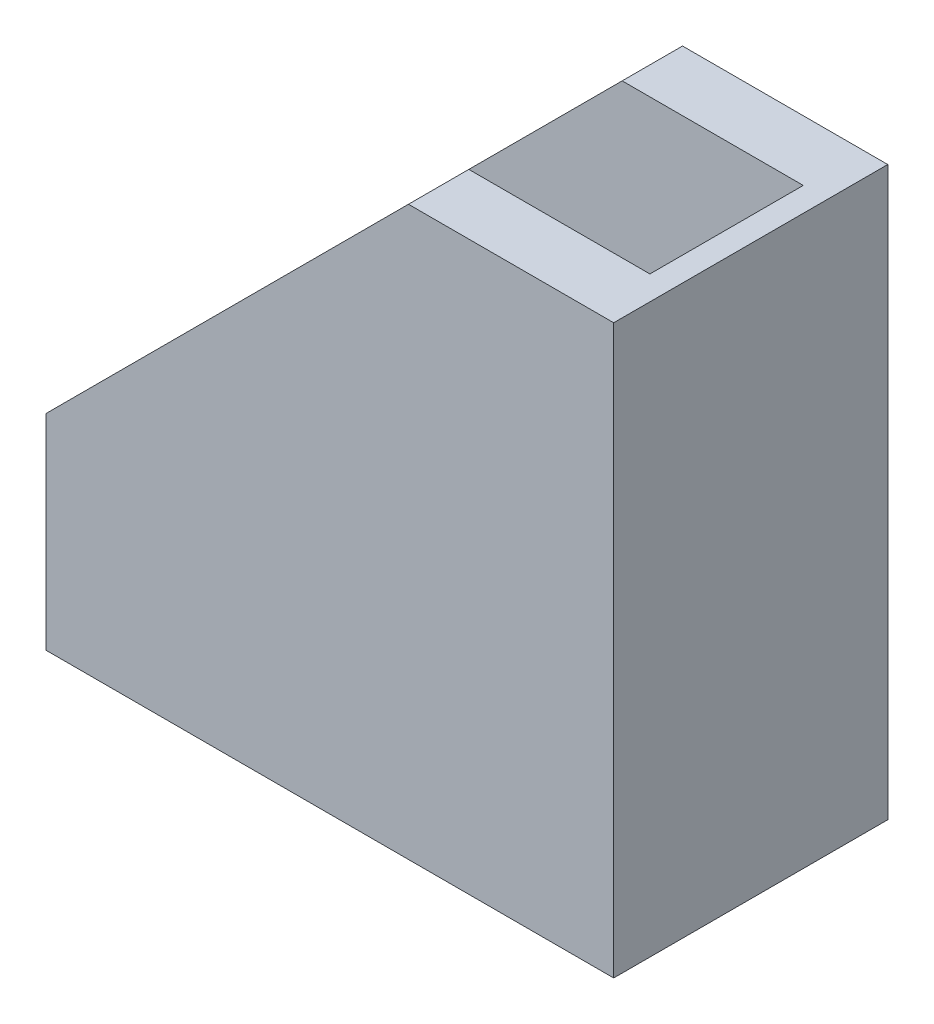
ISO-10303-21;
HEADER;
FILE_DESCRIPTION(('STEP AP214'),'2;1');
FILE_NAME('part.step','',(''),(''),'','','');
FILE_SCHEMA(('AUTOMOTIVE_DESIGN { 1 0 10303 214 1 1 1 1 }'));
ENDSEC;
DATA;
#1=APPLICATION_CONTEXT('core data for automotive mechanical design processes');
#2=APPLICATION_PROTOCOL_DEFINITION('international standard','automotive_design',2000,#1);
#3=PRODUCT_CONTEXT('',#1,'mechanical');
#4=PRODUCT('Part','Part','',(#3));
#5=PRODUCT_RELATED_PRODUCT_CATEGORY('part','',(#4));
#6=PRODUCT_DEFINITION_FORMATION('','',#4);
#7=PRODUCT_DEFINITION_CONTEXT('part definition',#1,'design');
#8=PRODUCT_DEFINITION('design','',#6,#7);
#9=PRODUCT_DEFINITION_SHAPE('','',#8);
#10=(LENGTH_UNIT() NAMED_UNIT(*) SI_UNIT(.MILLI.,.METRE.));
#11=(NAMED_UNIT(*) PLANE_ANGLE_UNIT() SI_UNIT($,.RADIAN.));
#12=(NAMED_UNIT(*) SI_UNIT($,.STERADIAN.) SOLID_ANGLE_UNIT());
#13=UNCERTAINTY_MEASURE_WITH_UNIT(LENGTH_MEASURE(1.E-05),#10,'distance_accuracy_value','');
#14=(GEOMETRIC_REPRESENTATION_CONTEXT(3) GLOBAL_UNCERTAINTY_ASSIGNED_CONTEXT((#13)) GLOBAL_UNIT_ASSIGNED_CONTEXT((#10,
#11,#12)) REPRESENTATION_CONTEXT('',''));
#15=CARTESIAN_POINT('',(0.,0.,0.));
#16=DIRECTION('',(0.,0.,1.));
#17=DIRECTION('',(1.,0.,0.));
#18=AXIS2_PLACEMENT_3D('',#15,#16,#17);
#19=CARTESIAN_POINT('',(-17.,47.,11.35));
#20=DIRECTION('',(0.707106781186548,-0.707106781186548,0.));
#21=DIRECTION('',(0.707106781186548,0.707106781186548,0.));
#22=AXIS2_PLACEMENT_3D('',#19,#20,#21);
#23=PLANE('',#22);
#24=DIRECTION('',(-0.707106781186547,-0.707106781186547,0.));
#25=VECTOR('',#24,1.);
#26=CARTESIAN_POINT('',(-47.,17.,6.35));
#27=LINE('',#26,#25);
#28=CARTESIAN_POINT('',(-17.,47.,6.35));
#29=VERTEX_POINT('',#28);
#30=CARTESIAN_POINT('',(-47.,17.,6.35));
#31=VERTEX_POINT('',#30);
#32=EDGE_CURVE('E172',#29,#31,#27,.T.);
#33=ORIENTED_EDGE('',*,*,#32,.T.);
#34=DIRECTION('',(0.,0.,-1.));
#35=VECTOR('',#34,1.);
#36=CARTESIAN_POINT('',(-47.,17.,11.35));
#37=LINE('',#36,#35);
#38=CARTESIAN_POINT('',(-47.,17.,11.35));
#39=VERTEX_POINT('',#38);
#40=EDGE_CURVE('E117',#39,#31,#37,.T.);
#41=ORIENTED_EDGE('',*,*,#40,.F.);
#42=DIRECTION('',(-0.707106781186547,-0.707106781186547,0.));
#43=VECTOR('',#42,1.);
#44=CARTESIAN_POINT('',(-17.,47.,11.35));
#45=LINE('',#44,#43);
#46=CARTESIAN_POINT('',(-17.,47.,11.35));
#47=VERTEX_POINT('',#46);
#48=EDGE_CURVE('E99',#47,#39,#45,.T.);
#49=ORIENTED_EDGE('',*,*,#48,.F.);
#50=DIRECTION('',(0.,0.,-1.));
#51=VECTOR('',#50,1.);
#52=CARTESIAN_POINT('',(-17.,47.,11.35));
#53=LINE('',#52,#51);
#54=EDGE_CURVE('E106',#47,#29,#53,.T.);
#55=ORIENTED_EDGE('',*,*,#54,.T.);
#56=EDGE_LOOP('',(#33,#41,#49,#55));
#57=FACE_BOUND('',#56,.T.);
#58=ADVANCED_FACE('F33',(#57),#23,.F.);
#59=CARTESIAN_POINT('',(0.,0.,11.35));
#60=DIRECTION('',(0.,1.,0.));
#61=DIRECTION('',(-1.,0.,0.));
#62=AXIS2_PLACEMENT_3D('',#59,#60,#61);
#63=PLANE('',#62);
#64=DIRECTION('',(1.,0.,0.));
#65=VECTOR('',#64,1.);
#66=CARTESIAN_POINT('',(0.,0.,-11.35));
#67=LINE('',#66,#65);
#68=CARTESIAN_POINT('',(-47.,0.,-11.35));
#69=VERTEX_POINT('',#68);
#70=CARTESIAN_POINT('',(0.,0.,-11.35));
#71=VERTEX_POINT('',#70);
#72=EDGE_CURVE('E123',#69,#71,#67,.T.);
#73=ORIENTED_EDGE('',*,*,#72,.T.);
#74=DIRECTION('',(0.,0.,-1.));
#75=VECTOR('',#74,1.);
#76=CARTESIAN_POINT('',(0.,0.,11.35));
#77=LINE('',#76,#75);
#78=CARTESIAN_POINT('',(0.,0.,11.35));
#79=VERTEX_POINT('',#78);
#80=EDGE_CURVE('E11',#79,#71,#77,.T.);
#81=ORIENTED_EDGE('',*,*,#80,.F.);
#82=DIRECTION('',(1.,0.,0.));
#83=VECTOR('',#82,1.);
#84=CARTESIAN_POINT('',(0.,0.,11.35));
#85=LINE('',#84,#83);
#86=CARTESIAN_POINT('',(-47.,0.,11.35));
#87=VERTEX_POINT('',#86);
#88=EDGE_CURVE('E136',#87,#79,#85,.T.);
#89=ORIENTED_EDGE('',*,*,#88,.F.);
#90=DIRECTION('',(0.,0.,-1.));
#91=VECTOR('',#90,1.);
#92=CARTESIAN_POINT('',(-47.,0.,11.35));
#93=LINE('',#92,#91);
#94=EDGE_CURVE('E119',#87,#69,#93,.T.);
#95=ORIENTED_EDGE('',*,*,#94,.T.);
#96=EDGE_LOOP('',(#73,#81,#89,#95));
#97=FACE_BOUND('',#96,.T.);
#98=ADVANCED_FACE('F35',(#97),#63,.F.);
#99=CARTESIAN_POINT('',(0.,0.,11.35));
#100=DIRECTION('',(-1.,0.,0.));
#101=DIRECTION('',(0.,0.,1.));
#102=AXIS2_PLACEMENT_3D('',#99,#100,#101);
#103=PLANE('',#102);
#104=DIRECTION('',(0.,1.,0.));
#105=VECTOR('',#104,1.);
#106=CARTESIAN_POINT('',(0.,0.,-11.35));
#107=LINE('',#106,#105);
#108=CARTESIAN_POINT('',(0.,47.,-11.35));
#109=VERTEX_POINT('',#108);
#110=EDGE_CURVE('E126',#71,#109,#107,.T.);
#111=ORIENTED_EDGE('',*,*,#110,.T.);
#112=DIRECTION('',(0.,0.,-1.));
#113=VECTOR('',#112,1.);
#114=CARTESIAN_POINT('',(0.,47.,11.35));
#115=LINE('',#114,#113);
#116=CARTESIAN_POINT('',(0.,47.,11.35));
#117=VERTEX_POINT('',#116);
#118=EDGE_CURVE('E41',#117,#109,#115,.T.);
#119=ORIENTED_EDGE('',*,*,#118,.F.);
#120=DIRECTION('',(0.,1.,0.));
#121=VECTOR('',#120,1.);
#122=CARTESIAN_POINT('',(0.,0.,11.35));
#123=LINE('',#122,#121);
#124=EDGE_CURVE('E88',#79,#117,#123,.T.);
#125=ORIENTED_EDGE('',*,*,#124,.F.);
#126=ORIENTED_EDGE('',*,*,#80,.T.);
#127=EDGE_LOOP('',(#111,#119,#125,#126));
#128=FACE_BOUND('',#127,.T.);
#129=ADVANCED_FACE('F211',(#128),#103,.F.);
#130=CARTESIAN_POINT('',(0.,47.,11.35));
#131=DIRECTION('',(0.,-1.,0.));
#132=DIRECTION('',(0.,0.,-1.));
#133=AXIS2_PLACEMENT_3D('',#130,#131,#132);
#134=PLANE('',#133);
#135=CARTESIAN_POINT('',(-17.,47.,-6.35));
#136=VERTEX_POINT('',#135);
#137=CARTESIAN_POINT('',(-17.,47.,-11.35));
#138=VERTEX_POINT('',#137);
#139=EDGE_CURVE('E114',#136,#138,#53,.T.);
#140=ORIENTED_EDGE('',*,*,#139,.F.);
#141=DIRECTION('',(-1.,0.,0.));
#142=VECTOR('',#141,1.);
#143=CARTESIAN_POINT('',(-17.,47.,-6.35));
#144=LINE('',#143,#142);
#145=CARTESIAN_POINT('',(-2.,47.,-6.35));
#146=VERTEX_POINT('',#145);
#147=EDGE_CURVE('E154',#146,#136,#144,.T.);
#148=ORIENTED_EDGE('',*,*,#147,.F.);
#149=DIRECTION('',(0.,0.,1.));
#150=VECTOR('',#149,1.);
#151=CARTESIAN_POINT('',(-2.,47.,-6.35));
#152=LINE('',#151,#150);
#153=CARTESIAN_POINT('',(-2.,47.,6.35));
#154=VERTEX_POINT('',#153);
#155=EDGE_CURVE('E127',#146,#154,#152,.T.);
#156=ORIENTED_EDGE('',*,*,#155,.T.);
#157=DIRECTION('',(-1.,0.,0.));
#158=VECTOR('',#157,1.);
#159=CARTESIAN_POINT('',(-17.,47.,6.35));
#160=LINE('',#159,#158);
#161=EDGE_CURVE('E111',#154,#29,#160,.T.);
#162=ORIENTED_EDGE('',*,*,#161,.T.);
#163=ORIENTED_EDGE('',*,*,#54,.F.);
#164=DIRECTION('',(-1.,0.,0.));
#165=VECTOR('',#164,1.);
#166=CARTESIAN_POINT('',(0.,47.,11.35));
#167=LINE('',#166,#165);
#168=EDGE_CURVE('E95',#117,#47,#167,.T.);
#169=ORIENTED_EDGE('',*,*,#168,.F.);
#170=ORIENTED_EDGE('',*,*,#118,.T.);
#171=DIRECTION('',(-1.,0.,0.));
#172=VECTOR('',#171,1.);
#173=CARTESIAN_POINT('',(0.,47.,-11.35));
#174=LINE('',#173,#172);
#175=EDGE_CURVE('E129',#109,#138,#174,.T.);
#176=ORIENTED_EDGE('',*,*,#175,.T.);
#177=EDGE_LOOP('',(#140,#148,#156,#162,#163,#169,#170,#176));
#178=FACE_BOUND('',#177,.T.);
#179=ADVANCED_FACE('F108',(#178),#134,.F.);
#180=CARTESIAN_POINT('',(-47.,17.,-6.35));
#181=VERTEX_POINT('',#180);
#182=CARTESIAN_POINT('',(-47.,17.,-11.35));
#183=VERTEX_POINT('',#182);
#184=EDGE_CURVE('E138',#181,#183,#37,.T.);
#185=ORIENTED_EDGE('',*,*,#184,.F.);
#186=DIRECTION('',(-0.707106781186547,-0.707106781186547,0.));
#187=VECTOR('',#186,1.);
#188=CARTESIAN_POINT('',(-47.,17.,-6.35));
#189=LINE('',#188,#187);
#190=EDGE_CURVE('E150',#136,#181,#189,.T.);
#191=ORIENTED_EDGE('',*,*,#190,.F.);
#192=ORIENTED_EDGE('',*,*,#139,.T.);
#193=DIRECTION('',(-0.707106781186547,-0.707106781186547,0.));
#194=VECTOR('',#193,1.);
#195=CARTESIAN_POINT('',(-17.,47.,-11.35));
#196=LINE('',#195,#194);
#197=EDGE_CURVE('E132',#138,#183,#196,.T.);
#198=ORIENTED_EDGE('',*,*,#197,.T.);
#199=EDGE_LOOP('',(#185,#191,#192,#198));
#200=FACE_BOUND('',#199,.T.);
#201=ADVANCED_FACE('F146',(#200),#23,.F.);
#202=CARTESIAN_POINT('',(-47.,0.,11.35));
#203=DIRECTION('',(1.,0.,0.));
#204=DIRECTION('',(0.,0.,-1.));
#205=AXIS2_PLACEMENT_3D('',#202,#203,#204);
#206=PLANE('',#205);
#207=DIRECTION('',(0.,0.,1.));
#208=VECTOR('',#207,1.);
#209=CARTESIAN_POINT('',(-47.,1.99999999999999,-6.35));
#210=LINE('',#209,#208);
#211=CARTESIAN_POINT('',(-47.,1.99999999999999,-6.35));
#212=VERTEX_POINT('',#211);
#213=CARTESIAN_POINT('',(-47.,1.99999999999999,6.35));
#214=VERTEX_POINT('',#213);
#215=EDGE_CURVE('E186',#212,#214,#210,.T.);
#216=ORIENTED_EDGE('',*,*,#215,.F.);
#217=DIRECTION('',(0.,-1.,0.));
#218=VECTOR('',#217,1.);
#219=CARTESIAN_POINT('',(-47.,17.,-6.35));
#220=LINE('',#219,#218);
#221=EDGE_CURVE('E192',#181,#212,#220,.T.);
#222=ORIENTED_EDGE('',*,*,#221,.F.);
#223=ORIENTED_EDGE('',*,*,#184,.T.);
#224=DIRECTION('',(0.,-1.,0.));
#225=VECTOR('',#224,1.);
#226=CARTESIAN_POINT('',(-47.,0.,-11.35));
#227=LINE('',#226,#225);
#228=EDGE_CURVE('E80',#183,#69,#227,.T.);
#229=ORIENTED_EDGE('',*,*,#228,.T.);
#230=ORIENTED_EDGE('',*,*,#94,.F.);
#231=DIRECTION('',(0.,-1.,0.));
#232=VECTOR('',#231,1.);
#233=CARTESIAN_POINT('',(-47.,0.,11.35));
#234=LINE('',#233,#232);
#235=EDGE_CURVE('E57',#39,#87,#234,.T.);
#236=ORIENTED_EDGE('',*,*,#235,.F.);
#237=ORIENTED_EDGE('',*,*,#40,.T.);
#238=DIRECTION('',(0.,-1.,0.));
#239=VECTOR('',#238,1.);
#240=CARTESIAN_POINT('',(-47.,17.,6.35));
#241=LINE('',#240,#239);
#242=EDGE_CURVE('E200',#31,#214,#241,.T.);
#243=ORIENTED_EDGE('',*,*,#242,.T.);
#244=EDGE_LOOP('',(#216,#222,#223,#229,#230,#236,#237,#243));
#245=FACE_BOUND('',#244,.T.);
#246=ADVANCED_FACE('F224',(#245),#206,.F.);
#247=CARTESIAN_POINT('',(0.,0.,11.35));
#248=DIRECTION('',(0.,0.,-1.));
#249=DIRECTION('',(-1.,0.,0.));
#250=AXIS2_PLACEMENT_3D('',#247,#248,#249);
#251=PLANE('',#250);
#252=ORIENTED_EDGE('',*,*,#88,.T.);
#253=ORIENTED_EDGE('',*,*,#124,.T.);
#254=ORIENTED_EDGE('',*,*,#168,.T.);
#255=ORIENTED_EDGE('',*,*,#48,.T.);
#256=ORIENTED_EDGE('',*,*,#235,.T.);
#257=EDGE_LOOP('',(#252,#253,#254,#255,#256));
#258=FACE_BOUND('',#257,.T.);
#259=ADVANCED_FACE('F97',(#258),#251,.F.);
#260=CARTESIAN_POINT('',(0.,0.,-11.35));
#261=DIRECTION('',(0.,0.,-1.));
#262=DIRECTION('',(-1.,0.,0.));
#263=AXIS2_PLACEMENT_3D('',#260,#261,#262);
#264=PLANE('',#263);
#265=ORIENTED_EDGE('',*,*,#72,.F.);
#266=ORIENTED_EDGE('',*,*,#228,.F.);
#267=ORIENTED_EDGE('',*,*,#197,.F.);
#268=ORIENTED_EDGE('',*,*,#175,.F.);
#269=ORIENTED_EDGE('',*,*,#110,.F.);
#270=EDGE_LOOP('',(#265,#266,#267,#268,#269));
#271=FACE_BOUND('',#270,.T.);
#272=ADVANCED_FACE('F143',(#271),#264,.T.);
#273=CARTESIAN_POINT('',(-2.,47.,-6.35));
#274=DIRECTION('',(1.,0.,0.));
#275=DIRECTION('',(0.,0.,-1.));
#276=AXIS2_PLACEMENT_3D('',#273,#274,#275);
#277=PLANE('',#276);
#278=DIRECTION('',(0.,1.,0.));
#279=VECTOR('',#278,1.);
#280=CARTESIAN_POINT('',(-2.,47.,6.35));
#281=LINE('',#280,#279);
#282=CARTESIAN_POINT('',(-2.,1.99999999999999,6.35));
#283=VERTEX_POINT('',#282);
#284=EDGE_CURVE('E170',#283,#154,#281,.T.);
#285=ORIENTED_EDGE('',*,*,#284,.T.);
#286=ORIENTED_EDGE('',*,*,#155,.F.);
#287=DIRECTION('',(0.,1.,0.));
#288=VECTOR('',#287,1.);
#289=CARTESIAN_POINT('',(-2.,47.,-6.35));
#290=LINE('',#289,#288);
#291=CARTESIAN_POINT('',(-2.,1.99999999999999,-6.35));
#292=VERTEX_POINT('',#291);
#293=EDGE_CURVE('E188',#292,#146,#290,.T.);
#294=ORIENTED_EDGE('',*,*,#293,.F.);
#295=DIRECTION('',(0.,0.,1.));
#296=VECTOR('',#295,1.);
#297=CARTESIAN_POINT('',(-2.,1.99999999999999,-6.35));
#298=LINE('',#297,#296);
#299=EDGE_CURVE('E181',#292,#283,#298,.T.);
#300=ORIENTED_EDGE('',*,*,#299,.T.);
#301=EDGE_LOOP('',(#285,#286,#294,#300));
#302=FACE_BOUND('',#301,.T.);
#303=ADVANCED_FACE('F189',(#302),#277,.F.);
#304=CARTESIAN_POINT('',(-2.,1.99999999999999,-6.35));
#305=DIRECTION('',(0.,-1.,0.));
#306=DIRECTION('',(0.,0.,-1.));
#307=AXIS2_PLACEMENT_3D('',#304,#305,#306);
#308=PLANE('',#307);
#309=DIRECTION('',(1.,0.,0.));
#310=VECTOR('',#309,1.);
#311=CARTESIAN_POINT('',(-2.,1.99999999999999,6.35));
#312=LINE('',#311,#310);
#313=EDGE_CURVE('E48',#214,#283,#312,.T.);
#314=ORIENTED_EDGE('',*,*,#313,.T.);
#315=ORIENTED_EDGE('',*,*,#299,.F.);
#316=DIRECTION('',(1.,0.,0.));
#317=VECTOR('',#316,1.);
#318=CARTESIAN_POINT('',(-2.,1.99999999999999,-6.35));
#319=LINE('',#318,#317);
#320=EDGE_CURVE('E185',#212,#292,#319,.T.);
#321=ORIENTED_EDGE('',*,*,#320,.F.);
#322=ORIENTED_EDGE('',*,*,#215,.T.);
#323=EDGE_LOOP('',(#314,#315,#321,#322));
#324=FACE_BOUND('',#323,.T.);
#325=ADVANCED_FACE('F183',(#324),#308,.F.);
#326=CARTESIAN_POINT('',(0.,0.,-6.35));
#327=DIRECTION('',(0.,0.,-1.));
#328=DIRECTION('',(-1.,0.,0.));
#329=AXIS2_PLACEMENT_3D('',#326,#327,#328);
#330=PLANE('',#329);
#331=ORIENTED_EDGE('',*,*,#190,.T.);
#332=ORIENTED_EDGE('',*,*,#221,.T.);
#333=ORIENTED_EDGE('',*,*,#320,.T.);
#334=ORIENTED_EDGE('',*,*,#293,.T.);
#335=ORIENTED_EDGE('',*,*,#147,.T.);
#336=EDGE_LOOP('',(#331,#332,#333,#334,#335));
#337=FACE_BOUND('',#336,.T.);
#338=ADVANCED_FACE('F191',(#337),#330,.F.);
#339=CARTESIAN_POINT('',(0.,0.,6.35));
#340=DIRECTION('',(0.,0.,-1.));
#341=DIRECTION('',(-1.,0.,0.));
#342=AXIS2_PLACEMENT_3D('',#339,#340,#341);
#343=PLANE('',#342);
#344=ORIENTED_EDGE('',*,*,#32,.F.);
#345=ORIENTED_EDGE('',*,*,#161,.F.);
#346=ORIENTED_EDGE('',*,*,#284,.F.);
#347=ORIENTED_EDGE('',*,*,#313,.F.);
#348=ORIENTED_EDGE('',*,*,#242,.F.);
#349=EDGE_LOOP('',(#344,#345,#346,#347,#348));
#350=FACE_BOUND('',#349,.T.);
#351=ADVANCED_FACE('F239',(#350),#343,.T.);
#352=CLOSED_SHELL('',(#58,#98,#129,#179,#201,#246,#259,#272,#303,#325,#338,#351));
#353=MANIFOLD_SOLID_BREP('B2',#352);
#354=ADVANCED_BREP_SHAPE_REPRESENTATION('',(#18,#353),#14);
#355=SHAPE_DEFINITION_REPRESENTATION(#9,#354);
ENDSEC;
END-ISO-10303-21;
